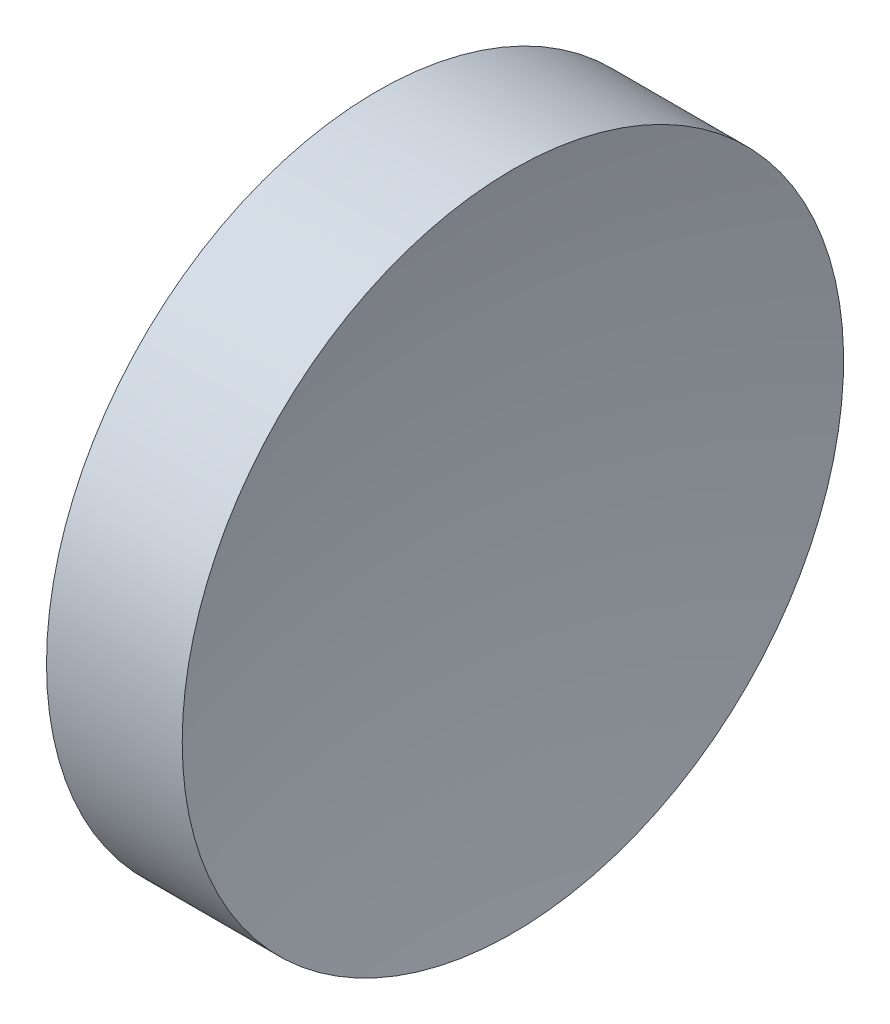
ISO-10303-21;
HEADER;
FILE_DESCRIPTION(('STEP AP214'),'2;1');
FILE_NAME('part.step','',(''),(''),'','','');
FILE_SCHEMA(('AUTOMOTIVE_DESIGN { 1 0 10303 214 1 1 1 1 }'));
ENDSEC;
DATA;
#1=APPLICATION_CONTEXT('core data for automotive mechanical design processes');
#2=APPLICATION_PROTOCOL_DEFINITION('international standard','automotive_design',2000,#1);
#3=PRODUCT_CONTEXT('',#1,'mechanical');
#4=PRODUCT('Part','Part','',(#3));
#5=PRODUCT_RELATED_PRODUCT_CATEGORY('part','',(#4));
#6=PRODUCT_DEFINITION_FORMATION('','',#4);
#7=PRODUCT_DEFINITION_CONTEXT('part definition',#1,'design');
#8=PRODUCT_DEFINITION('design','',#6,#7);
#9=PRODUCT_DEFINITION_SHAPE('','',#8);
#10=(LENGTH_UNIT() NAMED_UNIT(*) SI_UNIT(.MILLI.,.METRE.));
#11=(NAMED_UNIT(*) PLANE_ANGLE_UNIT() SI_UNIT($,.RADIAN.));
#12=(NAMED_UNIT(*) SI_UNIT($,.STERADIAN.) SOLID_ANGLE_UNIT());
#13=UNCERTAINTY_MEASURE_WITH_UNIT(LENGTH_MEASURE(1.E-05),#10,'distance_accuracy_value','');
#14=(GEOMETRIC_REPRESENTATION_CONTEXT(3) GLOBAL_UNCERTAINTY_ASSIGNED_CONTEXT((#13)) GLOBAL_UNIT_ASSIGNED_CONTEXT((#10,
#11,#12)) REPRESENTATION_CONTEXT('',''));
#15=CARTESIAN_POINT('',(0.,0.,0.));
#16=DIRECTION('',(0.,0.,1.));
#17=DIRECTION('',(1.,0.,0.));
#18=AXIS2_PLACEMENT_3D('',#15,#16,#17);
#19=CARTESIAN_POINT('',(72.1217112122072,28.4775956346375,0.));
#20=DIRECTION('',(-1.,0.,0.));
#21=DIRECTION('',(0.,1.,0.));
#22=AXIS2_PLACEMENT_3D('',#19,#20,#21);
#23=SPHERICAL_SURFACE('',#22,22.92);
#24=CARTESIAN_POINT('',(49.7537341020615,28.4775956346375,0.));
#25=DIRECTION('',(-1.,0.,0.));
#26=DIRECTION('',(0.,0.,1.));
#27=AXIS2_PLACEMENT_3D('',#24,#25,#26);
#28=CIRCLE('',#27,5.);
#29=CARTESIAN_POINT('',(49.7537341020615,28.4775956346375,5.));
#30=VERTEX_POINT('',#29);
#31=EDGE_CURVE('E10',#30,#30,#28,.T.);
#32=ORIENTED_EDGE('',*,*,#31,.F.);
#33=EDGE_LOOP('',(#32));
#34=FACE_BOUND('',#33,.T.);
#35=ADVANCED_FACE('F35',(#34),#23,.F.);
#36=CARTESIAN_POINT('',(44.7820919030242,28.4775956346375,0.));
#37=DIRECTION('',(-1.,0.,0.));
#38=DIRECTION('',(0.,0.,1.));
#39=AXIS2_PLACEMENT_3D('',#36,#37,#38);
#40=CYLINDRICAL_SURFACE('',#39,5.);
#41=CARTESIAN_POINT('',(47.7017112122072,28.4775956346375,0.));
#42=DIRECTION('',(-1.,0.,0.));
#43=DIRECTION('',(0.,0.,1.));
#44=AXIS2_PLACEMENT_3D('',#41,#42,#43);
#45=CIRCLE('',#44,5.);
#46=CARTESIAN_POINT('',(47.7017112122072,28.4775956346375,5.));
#47=VERTEX_POINT('',#46);
#48=EDGE_CURVE('E41',#47,#47,#45,.T.);
#49=ORIENTED_EDGE('',*,*,#48,.F.);
#50=EDGE_LOOP('',(#49));
#51=FACE_BOUND('',#50,.T.);
#52=ORIENTED_EDGE('',*,*,#31,.T.);
#53=EDGE_LOOP('',(#52));
#54=FACE_BOUND('',#53,.T.);
#55=ADVANCED_FACE('F49',(#51,#54),#40,.T.);
#56=CARTESIAN_POINT('',(47.7017112122072,28.4775956346375,0.));
#57=DIRECTION('',(1.,0.,0.));
#58=DIRECTION('',(0.,0.,-1.));
#59=AXIS2_PLACEMENT_3D('',#56,#57,#58);
#60=PLANE('',#59);
#61=ORIENTED_EDGE('',*,*,#48,.T.);
#62=EDGE_LOOP('',(#61));
#63=FACE_BOUND('',#62,.T.);
#64=ADVANCED_FACE('F47',(#63),#60,.F.);
#65=CLOSED_SHELL('',(#35,#55,#64));
#66=MANIFOLD_SOLID_BREP('B2',#65);
#67=ADVANCED_BREP_SHAPE_REPRESENTATION('',(#18,#66),#14);
#68=SHAPE_DEFINITION_REPRESENTATION(#9,#67);
ENDSEC;
END-ISO-10303-21;
